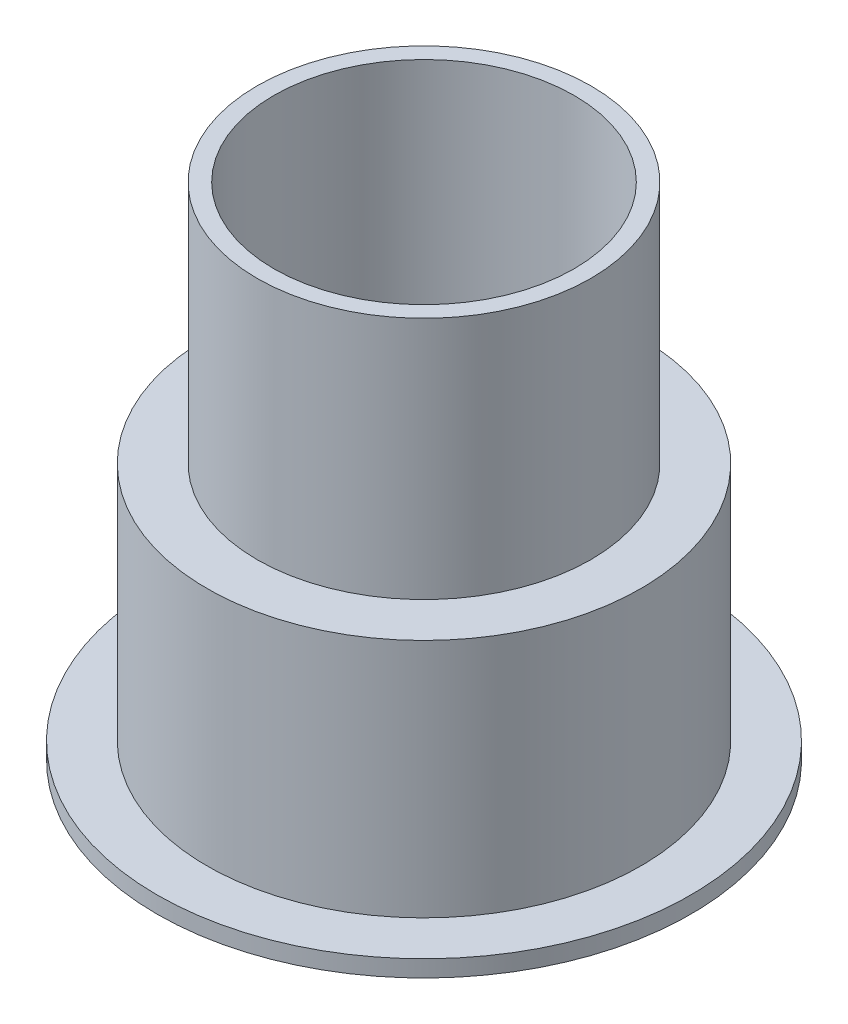
ISO-10303-21;
HEADER;
FILE_DESCRIPTION(('STEP AP214'),'2;1');
FILE_NAME('part.step','',(''),(''),'','','');
FILE_SCHEMA(('AUTOMOTIVE_DESIGN { 1 0 10303 214 1 1 1 1 }'));
ENDSEC;
DATA;
#1=APPLICATION_CONTEXT('core data for automotive mechanical design processes');
#2=APPLICATION_PROTOCOL_DEFINITION('international standard','automotive_design',2000,#1);
#3=PRODUCT_CONTEXT('',#1,'mechanical');
#4=PRODUCT('Part','Part','',(#3));
#5=PRODUCT_RELATED_PRODUCT_CATEGORY('part','',(#4));
#6=PRODUCT_DEFINITION_FORMATION('','',#4);
#7=PRODUCT_DEFINITION_CONTEXT('part definition',#1,'design');
#8=PRODUCT_DEFINITION('design','',#6,#7);
#9=PRODUCT_DEFINITION_SHAPE('','',#8);
#10=(LENGTH_UNIT() NAMED_UNIT(*) SI_UNIT(.MILLI.,.METRE.));
#11=(NAMED_UNIT(*) PLANE_ANGLE_UNIT() SI_UNIT($,.RADIAN.));
#12=(NAMED_UNIT(*) SI_UNIT($,.STERADIAN.) SOLID_ANGLE_UNIT());
#13=UNCERTAINTY_MEASURE_WITH_UNIT(LENGTH_MEASURE(1.E-05),#10,'distance_accuracy_value','');
#14=(GEOMETRIC_REPRESENTATION_CONTEXT(3) GLOBAL_UNCERTAINTY_ASSIGNED_CONTEXT((#13)) GLOBAL_UNIT_ASSIGNED_CONTEXT((#10,
#11,#12)) REPRESENTATION_CONTEXT('',''));
#15=CARTESIAN_POINT('',(0.,0.,0.));
#16=DIRECTION('',(0.,0.,1.));
#17=DIRECTION('',(1.,0.,0.));
#18=AXIS2_PLACEMENT_3D('',#15,#16,#17);
#19=CARTESIAN_POINT('',(6.,-0.854835863287098,0.));
#20=DIRECTION('',(0.,-1.,0.));
#21=DIRECTION('',(0.,0.,-1.));
#22=AXIS2_PLACEMENT_3D('',#19,#20,#21);
#23=PLANE('',#22);
#24=CARTESIAN_POINT('',(0.,-0.854835863287098,0.));
#25=DIRECTION('',(0.,-1.,0.));
#26=DIRECTION('',(0.,0.,-1.));
#27=AXIS2_PLACEMENT_3D('',#24,#25,#26);
#28=CIRCLE('',#27,8.);
#29=CARTESIAN_POINT('',(0.,-0.854835863287098,-8.));
#30=VERTEX_POINT('',#29);
#31=EDGE_CURVE('E10',#30,#30,#28,.T.);
#32=ORIENTED_EDGE('',*,*,#31,.T.);
#33=EDGE_LOOP('',(#32));
#34=FACE_BOUND('',#33,.T.);
#35=CARTESIAN_POINT('',(0.,-0.854835863287098,0.));
#36=DIRECTION('',(0.,-1.,0.));
#37=DIRECTION('',(0.,0.,-1.));
#38=AXIS2_PLACEMENT_3D('',#35,#36,#37);
#39=CIRCLE('',#38,6.);
#40=CARTESIAN_POINT('',(0.,-0.854835863287098,-6.));
#41=VERTEX_POINT('',#40);
#42=EDGE_CURVE('E71',#41,#41,#39,.T.);
#43=ORIENTED_EDGE('',*,*,#42,.F.);
#44=EDGE_LOOP('',(#43));
#45=FACE_BOUND('',#44,.T.);
#46=ADVANCED_FACE('F37',(#34,#45),#23,.T.);
#47=CARTESIAN_POINT('',(0.,0.,0.));
#48=DIRECTION('',(0.,-1.,0.));
#49=DIRECTION('',(0.,0.,-1.));
#50=AXIS2_PLACEMENT_3D('',#47,#48,#49);
#51=CYLINDRICAL_SURFACE('',#50,8.);
#52=CARTESIAN_POINT('',(0.,-0.354835863287098,0.));
#53=DIRECTION('',(0.,-1.,0.));
#54=DIRECTION('',(0.,0.,-1.));
#55=AXIS2_PLACEMENT_3D('',#52,#53,#54);
#56=CIRCLE('',#55,8.);
#57=CARTESIAN_POINT('',(0.,-0.354835863287098,-8.));
#58=VERTEX_POINT('',#57);
#59=EDGE_CURVE('E43',#58,#58,#56,.T.);
#60=ORIENTED_EDGE('',*,*,#59,.T.);
#61=EDGE_LOOP('',(#60));
#62=FACE_BOUND('',#61,.T.);
#63=ORIENTED_EDGE('',*,*,#31,.F.);
#64=EDGE_LOOP('',(#63));
#65=FACE_BOUND('',#64,.T.);
#66=ADVANCED_FACE('F79',(#62,#65),#51,.T.);
#67=CARTESIAN_POINT('',(6.5,-0.354835863287098,0.));
#68=DIRECTION('',(0.,1.,0.));
#69=DIRECTION('',(0.,0.,1.));
#70=AXIS2_PLACEMENT_3D('',#67,#68,#69);
#71=PLANE('',#70);
#72=CARTESIAN_POINT('',(0.,-0.354835863287098,0.));
#73=DIRECTION('',(0.,-1.,0.));
#74=DIRECTION('',(0.,0.,-1.));
#75=AXIS2_PLACEMENT_3D('',#72,#73,#74);
#76=CIRCLE('',#75,6.5);
#77=CARTESIAN_POINT('',(0.,-0.354835863287098,-6.5));
#78=VERTEX_POINT('',#77);
#79=EDGE_CURVE('E47',#78,#78,#76,.T.);
#80=ORIENTED_EDGE('',*,*,#79,.T.);
#81=EDGE_LOOP('',(#80));
#82=FACE_BOUND('',#81,.T.);
#83=ORIENTED_EDGE('',*,*,#59,.F.);
#84=EDGE_LOOP('',(#83));
#85=FACE_BOUND('',#84,.T.);
#86=ADVANCED_FACE('F83',(#82,#85),#71,.T.);
#87=CARTESIAN_POINT('',(0.,0.,0.));
#88=DIRECTION('',(0.,-1.,0.));
#89=DIRECTION('',(0.,0.,-1.));
#90=AXIS2_PLACEMENT_3D('',#87,#88,#89);
#91=CYLINDRICAL_SURFACE('',#90,6.5);
#92=CARTESIAN_POINT('',(0.,6.8451641367129,0.));
#93=DIRECTION('',(0.,-1.,0.));
#94=DIRECTION('',(0.,0.,-1.));
#95=AXIS2_PLACEMENT_3D('',#92,#93,#94);
#96=CIRCLE('',#95,6.5);
#97=CARTESIAN_POINT('',(0.,6.8451641367129,-6.5));
#98=VERTEX_POINT('',#97);
#99=EDGE_CURVE('E51',#98,#98,#96,.T.);
#100=ORIENTED_EDGE('',*,*,#99,.T.);
#101=EDGE_LOOP('',(#100));
#102=FACE_BOUND('',#101,.T.);
#103=ORIENTED_EDGE('',*,*,#79,.F.);
#104=EDGE_LOOP('',(#103));
#105=FACE_BOUND('',#104,.T.);
#106=ADVANCED_FACE('F87',(#102,#105),#91,.T.);
#107=CARTESIAN_POINT('',(6.5,6.8451641367129,0.));
#108=DIRECTION('',(0.,1.,0.));
#109=DIRECTION('',(0.,0.,1.));
#110=AXIS2_PLACEMENT_3D('',#107,#108,#109);
#111=PLANE('',#110);
#112=CARTESIAN_POINT('',(0.,6.8451641367129,0.));
#113=DIRECTION('',(0.,-1.,0.));
#114=DIRECTION('',(0.,0.,-1.));
#115=AXIS2_PLACEMENT_3D('',#112,#113,#114);
#116=CIRCLE('',#115,5.);
#117=CARTESIAN_POINT('',(0.,6.8451641367129,-5.));
#118=VERTEX_POINT('',#117);
#119=EDGE_CURVE('E56',#118,#118,#116,.T.);
#120=ORIENTED_EDGE('',*,*,#119,.T.);
#121=EDGE_LOOP('',(#120));
#122=FACE_BOUND('',#121,.T.);
#123=ORIENTED_EDGE('',*,*,#99,.F.);
#124=EDGE_LOOP('',(#123));
#125=FACE_BOUND('',#124,.T.);
#126=ADVANCED_FACE('F94',(#122,#125),#111,.T.);
#127=CARTESIAN_POINT('',(0.,0.,0.));
#128=DIRECTION('',(0.,-1.,0.));
#129=DIRECTION('',(0.,0.,-1.));
#130=AXIS2_PLACEMENT_3D('',#127,#128,#129);
#131=CYLINDRICAL_SURFACE('',#130,5.);
#132=CARTESIAN_POINT('',(0.,14.1451641367129,0.));
#133=DIRECTION('',(0.,-1.,0.));
#134=DIRECTION('',(0.,0.,-1.));
#135=AXIS2_PLACEMENT_3D('',#132,#133,#134);
#136=CIRCLE('',#135,5.);
#137=CARTESIAN_POINT('',(0.,14.1451641367129,-5.));
#138=VERTEX_POINT('',#137);
#139=EDGE_CURVE('E59',#138,#138,#136,.T.);
#140=ORIENTED_EDGE('',*,*,#139,.T.);
#141=EDGE_LOOP('',(#140));
#142=FACE_BOUND('',#141,.T.);
#143=ORIENTED_EDGE('',*,*,#119,.F.);
#144=EDGE_LOOP('',(#143));
#145=FACE_BOUND('',#144,.T.);
#146=ADVANCED_FACE('F98',(#142,#145),#131,.T.);
#147=CARTESIAN_POINT('',(4.5,14.1451641367129,0.));
#148=DIRECTION('',(0.,1.,0.));
#149=DIRECTION('',(0.,0.,1.));
#150=AXIS2_PLACEMENT_3D('',#147,#148,#149);
#151=PLANE('',#150);
#152=CARTESIAN_POINT('',(0.,14.1451641367129,0.));
#153=DIRECTION('',(0.,-1.,0.));
#154=DIRECTION('',(0.,0.,-1.));
#155=AXIS2_PLACEMENT_3D('',#152,#153,#154);
#156=CIRCLE('',#155,4.5);
#157=CARTESIAN_POINT('',(0.,14.1451641367129,-4.5));
#158=VERTEX_POINT('',#157);
#159=EDGE_CURVE('E62',#158,#158,#156,.T.);
#160=ORIENTED_EDGE('',*,*,#159,.T.);
#161=EDGE_LOOP('',(#160));
#162=FACE_BOUND('',#161,.T.);
#163=ORIENTED_EDGE('',*,*,#139,.F.);
#164=EDGE_LOOP('',(#163));
#165=FACE_BOUND('',#164,.T.);
#166=ADVANCED_FACE('F102',(#162,#165),#151,.T.);
#167=CARTESIAN_POINT('',(0.,0.,0.));
#168=DIRECTION('',(0.,-1.,0.));
#169=DIRECTION('',(0.,0.,-1.));
#170=AXIS2_PLACEMENT_3D('',#167,#168,#169);
#171=CYLINDRICAL_SURFACE('',#170,4.5);
#172=CARTESIAN_POINT('',(0.,6.8451641367129,0.));
#173=DIRECTION('',(0.,-1.,0.));
#174=DIRECTION('',(0.,0.,-1.));
#175=AXIS2_PLACEMENT_3D('',#172,#173,#174);
#176=CIRCLE('',#175,4.5);
#177=CARTESIAN_POINT('',(0.,6.8451641367129,-4.5));
#178=VERTEX_POINT('',#177);
#179=EDGE_CURVE('E65',#178,#178,#176,.T.);
#180=ORIENTED_EDGE('',*,*,#179,.T.);
#181=EDGE_LOOP('',(#180));
#182=FACE_BOUND('',#181,.T.);
#183=ORIENTED_EDGE('',*,*,#159,.F.);
#184=EDGE_LOOP('',(#183));
#185=FACE_BOUND('',#184,.T.);
#186=ADVANCED_FACE('F106',(#182,#185),#171,.F.);
#187=CARTESIAN_POINT('',(4.5,6.8451641367129,0.));
#188=DIRECTION('',(0.,1.,0.));
#189=DIRECTION('',(0.,0.,1.));
#190=AXIS2_PLACEMENT_3D('',#187,#188,#189);
#191=PLANE('',#190);
#192=ORIENTED_EDGE('',*,*,#179,.F.);
#193=EDGE_LOOP('',(#192));
#194=FACE_BOUND('',#193,.T.);
#195=ADVANCED_FACE('F110',(#194),#191,.T.);
#196=CARTESIAN_POINT('',(6.,6.1451641367129,0.));
#197=DIRECTION('',(0.,-1.,0.));
#198=DIRECTION('',(0.,0.,-1.));
#199=AXIS2_PLACEMENT_3D('',#196,#197,#198);
#200=PLANE('',#199);
#201=CARTESIAN_POINT('',(0.,6.1451641367129,0.));
#202=DIRECTION('',(0.,-1.,0.));
#203=DIRECTION('',(0.,0.,-1.));
#204=AXIS2_PLACEMENT_3D('',#201,#202,#203);
#205=CIRCLE('',#204,6.);
#206=CARTESIAN_POINT('',(0.,6.1451641367129,-6.));
#207=VERTEX_POINT('',#206);
#208=EDGE_CURVE('E68',#207,#207,#205,.T.);
#209=ORIENTED_EDGE('',*,*,#208,.T.);
#210=EDGE_LOOP('',(#209));
#211=FACE_BOUND('',#210,.T.);
#212=ADVANCED_FACE('F114',(#211),#200,.T.);
#213=CARTESIAN_POINT('',(0.,0.,0.));
#214=DIRECTION('',(0.,-1.,0.));
#215=DIRECTION('',(0.,0.,-1.));
#216=AXIS2_PLACEMENT_3D('',#213,#214,#215);
#217=CYLINDRICAL_SURFACE('',#216,6.);
#218=ORIENTED_EDGE('',*,*,#42,.T.);
#219=EDGE_LOOP('',(#218));
#220=FACE_BOUND('',#219,.T.);
#221=ORIENTED_EDGE('',*,*,#208,.F.);
#222=EDGE_LOOP('',(#221));
#223=FACE_BOUND('',#222,.T.);
#224=ADVANCED_FACE('F75',(#220,#223),#217,.F.);
#225=CLOSED_SHELL('',(#46,#66,#86,#106,#126,#146,#166,#186,#195,#212,#224));
#226=MANIFOLD_SOLID_BREP('B2',#225);
#227=ADVANCED_BREP_SHAPE_REPRESENTATION('',(#18,#226),#14);
#228=SHAPE_DEFINITION_REPRESENTATION(#9,#227);
ENDSEC;
END-ISO-10303-21;
